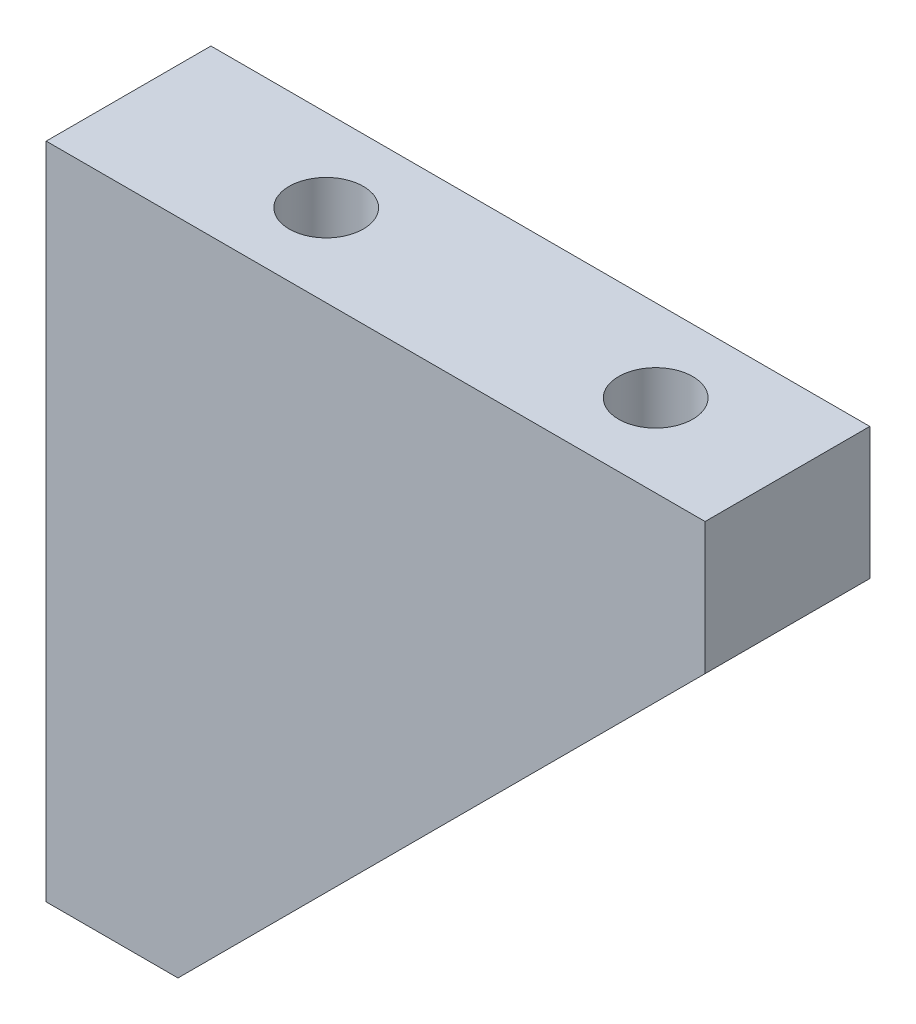
ISO-10303-21;
HEADER;
FILE_DESCRIPTION(('STEP AP214'),'2;1');
FILE_NAME('part.step','',(''),(''),'','','');
FILE_SCHEMA(('AUTOMOTIVE_DESIGN { 1 0 10303 214 1 1 1 1 }'));
ENDSEC;
DATA;
#1=APPLICATION_CONTEXT('core data for automotive mechanical design processes');
#2=APPLICATION_PROTOCOL_DEFINITION('international standard','automotive_design',2000,#1);
#3=PRODUCT_CONTEXT('',#1,'mechanical');
#4=PRODUCT('Part','Part','',(#3));
#5=PRODUCT_RELATED_PRODUCT_CATEGORY('part','',(#4));
#6=PRODUCT_DEFINITION_FORMATION('','',#4);
#7=PRODUCT_DEFINITION_CONTEXT('part definition',#1,'design');
#8=PRODUCT_DEFINITION('design','',#6,#7);
#9=PRODUCT_DEFINITION_SHAPE('','',#8);
#10=(LENGTH_UNIT() NAMED_UNIT(*) SI_UNIT(.MILLI.,.METRE.));
#11=(NAMED_UNIT(*) PLANE_ANGLE_UNIT() SI_UNIT($,.RADIAN.));
#12=(NAMED_UNIT(*) SI_UNIT($,.STERADIAN.) SOLID_ANGLE_UNIT());
#13=UNCERTAINTY_MEASURE_WITH_UNIT(LENGTH_MEASURE(1.E-05),#10,'distance_accuracy_value','');
#14=(GEOMETRIC_REPRESENTATION_CONTEXT(3) GLOBAL_UNCERTAINTY_ASSIGNED_CONTEXT((#13)) GLOBAL_UNIT_ASSIGNED_CONTEXT((#10,
#11,#12)) REPRESENTATION_CONTEXT('',''));
#15=CARTESIAN_POINT('',(0.,0.,0.));
#16=DIRECTION('',(0.,0.,1.));
#17=DIRECTION('',(1.,0.,0.));
#18=AXIS2_PLACEMENT_3D('',#15,#16,#17);
#19=CARTESIAN_POINT('',(0.,0.,10.));
#20=DIRECTION('',(1.,0.,0.));
#21=DIRECTION('',(0.,1.,0.));
#22=AXIS2_PLACEMENT_3D('',#19,#20,#21);
#23=PLANE('',#22);
#24=CARTESIAN_POINT('',(0.,-12.,5.));
#25=DIRECTION('',(-1.,0.,0.));
#26=DIRECTION('',(0.,0.,1.));
#27=AXIS2_PLACEMENT_3D('',#24,#25,#26);
#28=CIRCLE('',#27,2.24999999999999);
#29=CARTESIAN_POINT('',(0.,-12.,7.24999999999999));
#30=VERTEX_POINT('',#29);
#31=EDGE_CURVE('E207',#30,#30,#28,.T.);
#32=ORIENTED_EDGE('',*,*,#31,.F.);
#33=EDGE_LOOP('',(#32));
#34=FACE_BOUND('',#33,.T.);
#35=CARTESIAN_POINT('',(0.,-32.,5.));
#36=DIRECTION('',(-1.,0.,0.));
#37=DIRECTION('',(0.,0.,1.));
#38=AXIS2_PLACEMENT_3D('',#35,#36,#37);
#39=CIRCLE('',#38,2.24999999999999);
#40=CARTESIAN_POINT('',(0.,-32.,7.24999999999999));
#41=VERTEX_POINT('',#40);
#42=EDGE_CURVE('E159',#41,#41,#39,.T.);
#43=ORIENTED_EDGE('',*,*,#42,.F.);
#44=EDGE_LOOP('',(#43));
#45=FACE_BOUND('',#44,.T.);
#46=DIRECTION('',(0.,-1.,0.));
#47=VECTOR('',#46,1.);
#48=CARTESIAN_POINT('',(0.,0.,0.));
#49=LINE('',#48,#47);
#50=CARTESIAN_POINT('',(0.,0.,0.));
#51=VERTEX_POINT('',#50);
#52=CARTESIAN_POINT('',(0.,-40.,0.));
#53=VERTEX_POINT('',#52);
#54=EDGE_CURVE('E122',#51,#53,#49,.T.);
#55=ORIENTED_EDGE('',*,*,#54,.T.);
#56=DIRECTION('',(0.,0.,-1.));
#57=VECTOR('',#56,1.);
#58=CARTESIAN_POINT('',(0.,-40.,10.));
#59=LINE('',#58,#57);
#60=CARTESIAN_POINT('',(0.,-40.,10.));
#61=VERTEX_POINT('',#60);
#62=EDGE_CURVE('E43',#61,#53,#59,.T.);
#63=ORIENTED_EDGE('',*,*,#62,.F.);
#64=DIRECTION('',(0.,-1.,0.));
#65=VECTOR('',#64,1.);
#66=CARTESIAN_POINT('',(0.,0.,10.));
#67=LINE('',#66,#65);
#68=CARTESIAN_POINT('',(0.,0.,10.));
#69=VERTEX_POINT('',#68);
#70=EDGE_CURVE('E132',#69,#61,#67,.T.);
#71=ORIENTED_EDGE('',*,*,#70,.F.);
#72=DIRECTION('',(0.,0.,-1.));
#73=VECTOR('',#72,1.);
#74=CARTESIAN_POINT('',(0.,0.,10.));
#75=LINE('',#74,#73);
#76=EDGE_CURVE('E118',#69,#51,#75,.T.);
#77=ORIENTED_EDGE('',*,*,#76,.T.);
#78=EDGE_LOOP('',(#55,#63,#71,#77));
#79=FACE_BOUND('',#78,.T.);
#80=ADVANCED_FACE('F36',(#34,#45,#79),#23,.F.);
#81=CARTESIAN_POINT('',(0.,-40.,10.));
#82=DIRECTION('',(0.,1.,0.));
#83=DIRECTION('',(0.,0.,1.));
#84=AXIS2_PLACEMENT_3D('',#81,#82,#83);
#85=PLANE('',#84);
#86=DIRECTION('',(1.,0.,0.));
#87=VECTOR('',#86,1.);
#88=CARTESIAN_POINT('',(0.,-40.,0.));
#89=LINE('',#88,#87);
#90=CARTESIAN_POINT('',(8.00000000000001,-40.,0.));
#91=VERTEX_POINT('',#90);
#92=EDGE_CURVE('E125',#53,#91,#89,.T.);
#93=ORIENTED_EDGE('',*,*,#92,.T.);
#94=DIRECTION('',(0.,0.,-1.));
#95=VECTOR('',#94,1.);
#96=CARTESIAN_POINT('',(8.00000000000001,-40.,10.));
#97=LINE('',#96,#95);
#98=CARTESIAN_POINT('',(8.00000000000001,-40.,10.));
#99=VERTEX_POINT('',#98);
#100=EDGE_CURVE('E113',#99,#91,#97,.T.);
#101=ORIENTED_EDGE('',*,*,#100,.F.);
#102=DIRECTION('',(1.,0.,0.));
#103=VECTOR('',#102,1.);
#104=CARTESIAN_POINT('',(0.,-40.,10.));
#105=LINE('',#104,#103);
#106=EDGE_CURVE('E91',#61,#99,#105,.T.);
#107=ORIENTED_EDGE('',*,*,#106,.F.);
#108=ORIENTED_EDGE('',*,*,#62,.T.);
#109=EDGE_LOOP('',(#93,#101,#107,#108));
#110=FACE_BOUND('',#109,.T.);
#111=ADVANCED_FACE('F136',(#110),#85,.F.);
#112=CARTESIAN_POINT('',(40.,-8.,10.));
#113=DIRECTION('',(-0.707106781186548,0.707106781186548,0.));
#114=DIRECTION('',(-0.707106781186548,-0.707106781186548,0.));
#115=AXIS2_PLACEMENT_3D('',#112,#113,#114);
#116=PLANE('',#115);
#117=DIRECTION('',(0.707106781186548,0.707106781186548,0.));
#118=VECTOR('',#117,1.);
#119=CARTESIAN_POINT('',(40.,-8.,0.));
#120=LINE('',#119,#118);
#121=CARTESIAN_POINT('',(40.,-8.,0.));
#122=VERTEX_POINT('',#121);
#123=EDGE_CURVE('E110',#91,#122,#120,.T.);
#124=ORIENTED_EDGE('',*,*,#123,.T.);
#125=DIRECTION('',(0.,0.,-1.));
#126=VECTOR('',#125,1.);
#127=CARTESIAN_POINT('',(40.,-8.,10.));
#128=LINE('',#127,#126);
#129=CARTESIAN_POINT('',(40.,-8.,10.));
#130=VERTEX_POINT('',#129);
#131=EDGE_CURVE('E107',#130,#122,#128,.T.);
#132=ORIENTED_EDGE('',*,*,#131,.F.);
#133=DIRECTION('',(0.707106781186548,0.707106781186548,0.));
#134=VECTOR('',#133,1.);
#135=CARTESIAN_POINT('',(40.,-8.,10.));
#136=LINE('',#135,#134);
#137=EDGE_CURVE('E97',#99,#130,#136,.T.);
#138=ORIENTED_EDGE('',*,*,#137,.F.);
#139=ORIENTED_EDGE('',*,*,#100,.T.);
#140=EDGE_LOOP('',(#124,#132,#138,#139));
#141=FACE_BOUND('',#140,.T.);
#142=ADVANCED_FACE('F108',(#141),#116,.F.);
#143=CARTESIAN_POINT('',(40.,0.,10.));
#144=DIRECTION('',(-1.,0.,0.));
#145=DIRECTION('',(0.,0.,1.));
#146=AXIS2_PLACEMENT_3D('',#143,#144,#145);
#147=PLANE('',#146);
#148=DIRECTION('',(0.,1.,0.));
#149=VECTOR('',#148,1.);
#150=CARTESIAN_POINT('',(40.,0.,0.));
#151=LINE('',#150,#149);
#152=CARTESIAN_POINT('',(40.,0.,0.));
#153=VERTEX_POINT('',#152);
#154=EDGE_CURVE('E129',#122,#153,#151,.T.);
#155=ORIENTED_EDGE('',*,*,#154,.T.);
#156=DIRECTION('',(0.,0.,-1.));
#157=VECTOR('',#156,1.);
#158=CARTESIAN_POINT('',(40.,0.,10.));
#159=LINE('',#158,#157);
#160=CARTESIAN_POINT('',(40.,0.,10.));
#161=VERTEX_POINT('',#160);
#162=EDGE_CURVE('E114',#161,#153,#159,.T.);
#163=ORIENTED_EDGE('',*,*,#162,.F.);
#164=DIRECTION('',(0.,1.,0.));
#165=VECTOR('',#164,1.);
#166=CARTESIAN_POINT('',(40.,0.,10.));
#167=LINE('',#166,#165);
#168=EDGE_CURVE('E101',#130,#161,#167,.T.);
#169=ORIENTED_EDGE('',*,*,#168,.F.);
#170=ORIENTED_EDGE('',*,*,#131,.T.);
#171=EDGE_LOOP('',(#155,#163,#169,#170));
#172=FACE_BOUND('',#171,.T.);
#173=ADVANCED_FACE('F116',(#172),#147,.F.);
#174=CARTESIAN_POINT('',(0.,0.,10.));
#175=DIRECTION('',(0.,-1.,0.));
#176=DIRECTION('',(0.,0.,-1.));
#177=AXIS2_PLACEMENT_3D('',#174,#175,#176);
#178=PLANE('',#177);
#179=CARTESIAN_POINT('',(12.,0.,5.));
#180=DIRECTION('',(0.,1.,0.));
#181=DIRECTION('',(0.,0.,1.));
#182=AXIS2_PLACEMENT_3D('',#179,#180,#181);
#183=CIRCLE('',#182,2.24999999999999);
#184=CARTESIAN_POINT('',(12.,0.,7.24999999999999));
#185=VERTEX_POINT('',#184);
#186=EDGE_CURVE('E153',#185,#185,#183,.T.);
#187=ORIENTED_EDGE('',*,*,#186,.F.);
#188=EDGE_LOOP('',(#187));
#189=FACE_BOUND('',#188,.T.);
#190=CARTESIAN_POINT('',(32.,0.,5.));
#191=DIRECTION('',(0.,1.,0.));
#192=DIRECTION('',(0.,0.,1.));
#193=AXIS2_PLACEMENT_3D('',#190,#191,#192);
#194=CIRCLE('',#193,2.24999999999999);
#195=CARTESIAN_POINT('',(32.,0.,7.24999999999999));
#196=VERTEX_POINT('',#195);
#197=EDGE_CURVE('E147',#196,#196,#194,.T.);
#198=ORIENTED_EDGE('',*,*,#197,.F.);
#199=EDGE_LOOP('',(#198));
#200=FACE_BOUND('',#199,.T.);
#201=DIRECTION('',(-1.,0.,0.));
#202=VECTOR('',#201,1.);
#203=CARTESIAN_POINT('',(0.,0.,0.));
#204=LINE('',#203,#202);
#205=EDGE_CURVE('E82',#153,#51,#204,.T.);
#206=ORIENTED_EDGE('',*,*,#205,.T.);
#207=ORIENTED_EDGE('',*,*,#76,.F.);
#208=DIRECTION('',(-1.,0.,0.));
#209=VECTOR('',#208,1.);
#210=CARTESIAN_POINT('',(0.,0.,10.));
#211=LINE('',#210,#209);
#212=EDGE_CURVE('E58',#161,#69,#211,.T.);
#213=ORIENTED_EDGE('',*,*,#212,.F.);
#214=ORIENTED_EDGE('',*,*,#162,.T.);
#215=EDGE_LOOP('',(#206,#207,#213,#214));
#216=FACE_BOUND('',#215,.T.);
#217=ADVANCED_FACE('F142',(#189,#200,#216),#178,.F.);
#218=CARTESIAN_POINT('',(0.,0.,10.));
#219=DIRECTION('',(0.,0.,1.));
#220=DIRECTION('',(1.,0.,0.));
#221=AXIS2_PLACEMENT_3D('',#218,#219,#220);
#222=PLANE('',#221);
#223=ORIENTED_EDGE('',*,*,#70,.T.);
#224=ORIENTED_EDGE('',*,*,#106,.T.);
#225=ORIENTED_EDGE('',*,*,#137,.T.);
#226=ORIENTED_EDGE('',*,*,#168,.T.);
#227=ORIENTED_EDGE('',*,*,#212,.T.);
#228=EDGE_LOOP('',(#223,#224,#225,#226,#227));
#229=FACE_BOUND('',#228,.T.);
#230=ADVANCED_FACE('F99',(#229),#222,.T.);
#231=CARTESIAN_POINT('',(0.,0.,0.));
#232=DIRECTION('',(0.,0.,1.));
#233=DIRECTION('',(1.,0.,0.));
#234=AXIS2_PLACEMENT_3D('',#231,#232,#233);
#235=PLANE('',#234);
#236=ORIENTED_EDGE('',*,*,#54,.F.);
#237=ORIENTED_EDGE('',*,*,#205,.F.);
#238=ORIENTED_EDGE('',*,*,#154,.F.);
#239=ORIENTED_EDGE('',*,*,#123,.F.);
#240=ORIENTED_EDGE('',*,*,#92,.F.);
#241=EDGE_LOOP('',(#236,#237,#238,#239,#240));
#242=FACE_BOUND('',#241,.T.);
#243=ADVANCED_FACE('F141',(#242),#235,.F.);
#244=CARTESIAN_POINT('',(32.,-9.99999999999999,5.));
#245=DIRECTION('',(0.,1.,0.));
#246=DIRECTION('',(0.,0.,1.));
#247=AXIS2_PLACEMENT_3D('',#244,#245,#246);
#248=CONICAL_SURFACE('',#247,2.24999999999999,1.02974425867665);
#249=CARTESIAN_POINT('',(32.,-11.351936392812,5.));
#250=VERTEX_POINT('',#249);
#251=VERTEX_LOOP('',#250);
#252=FACE_BOUND('',#251,.T.);
#253=CARTESIAN_POINT('',(32.,-9.99999999999999,5.));
#254=DIRECTION('',(0.,1.,0.));
#255=DIRECTION('',(0.,0.,1.));
#256=AXIS2_PLACEMENT_3D('',#253,#254,#255);
#257=CIRCLE('',#256,2.24999999999999);
#258=CARTESIAN_POINT('',(32.,-9.99999999999999,7.24999999999999));
#259=VERTEX_POINT('',#258);
#260=EDGE_CURVE('E126',#259,#259,#257,.T.);
#261=ORIENTED_EDGE('',*,*,#260,.T.);
#262=EDGE_LOOP('',(#261));
#263=FACE_BOUND('',#262,.T.);
#264=ADVANCED_FACE('F256',(#252,#263),#248,.F.);
#265=CARTESIAN_POINT('',(32.,0.,5.));
#266=DIRECTION('',(0.,1.,0.));
#267=DIRECTION('',(0.,0.,1.));
#268=AXIS2_PLACEMENT_3D('',#265,#266,#267);
#269=CYLINDRICAL_SURFACE('',#268,2.24999999999999);
#270=ORIENTED_EDGE('',*,*,#260,.F.);
#271=EDGE_LOOP('',(#270));
#272=FACE_BOUND('',#271,.T.);
#273=ORIENTED_EDGE('',*,*,#197,.T.);
#274=EDGE_LOOP('',(#273));
#275=FACE_BOUND('',#274,.T.);
#276=ADVANCED_FACE('F195',(#272,#275),#269,.F.);
#277=CARTESIAN_POINT('',(12.,-9.99999999999999,5.));
#278=DIRECTION('',(0.,1.,0.));
#279=DIRECTION('',(0.,0.,1.));
#280=AXIS2_PLACEMENT_3D('',#277,#278,#279);
#281=CONICAL_SURFACE('',#280,2.24999999999999,1.02974425867665);
#282=CARTESIAN_POINT('',(12.,-11.351936392812,5.));
#283=VERTEX_POINT('',#282);
#284=VERTEX_LOOP('',#283);
#285=FACE_BOUND('',#284,.T.);
#286=CARTESIAN_POINT('',(12.,-9.99999999999999,5.));
#287=DIRECTION('',(0.,1.,0.));
#288=DIRECTION('',(0.,0.,1.));
#289=AXIS2_PLACEMENT_3D('',#286,#287,#288);
#290=CIRCLE('',#289,2.24999999999999);
#291=CARTESIAN_POINT('',(10.,-10.,6.03077640640438));
#292=VERTEX_POINT('',#291);
#293=CARTESIAN_POINT('',(9.99999999999999,-9.99999999999999,3.96922359359563));
#294=VERTEX_POINT('',#293);
#295=EDGE_CURVE('E150',#292,#294,#290,.T.);
#296=ORIENTED_EDGE('',*,*,#295,.T.);
#297=CARTESIAN_POINT('',(9.9998,-9.9998,3.96888510711605));
#298=CARTESIAN_POINT('',(10.0199713671876,-10.0199713671876,4.00304368759368));
#299=CARTESIAN_POINT('',(10.0399347553037,-10.0399347553037,4.03745606853985));
#300=CARTESIAN_POINT('',(10.0792951938878,-10.0792951938878,4.1069816294224));
#301=CARTESIAN_POINT('',(10.0986916153932,-10.0986916153932,4.14209551994402));
#302=CARTESIAN_POINT('',(10.1371913053952,-10.1371913053952,4.21401815912332));
#303=CARTESIAN_POINT('',(10.1562756455043,-10.1562756455043,4.25084735231351));
#304=CARTESIAN_POINT('',(10.1933375474993,-10.1933375474993,4.32558538433086));
#305=CARTESIAN_POINT('',(10.2113155369315,-10.2113155369315,4.36349379770676));
#306=CARTESIAN_POINT('',(10.2548468244322,-10.2548468244322,4.46102160591788));
#307=CARTESIAN_POINT('',(10.2794006667861,-10.279400666786,4.52155661280197));
#308=CARTESIAN_POINT('',(10.3222673136825,-10.3222673136825,4.64661637588643));
#309=CARTESIAN_POINT('',(10.3406278359546,-10.3406278359546,4.71110588075772));
#310=CARTESIAN_POINT('',(10.3626495285248,-10.3626495285248,4.82198736450129));
#311=CARTESIAN_POINT('',(10.3691755369963,-10.3691755369963,4.86719347725636));
#312=CARTESIAN_POINT('',(10.3764962122605,-10.3764962122605,4.95848403343301));
#313=CARTESIAN_POINT('',(10.3773033587189,-10.3773033587189,5.00456634417167));
#314=CARTESIAN_POINT('',(10.3730463791922,-10.3730463791922,5.09607528256868));
#315=CARTESIAN_POINT('',(10.3679916847553,-10.3679916847553,5.14150284477458));
#316=CARTESIAN_POINT('',(10.3529902905356,-10.3529902905356,5.23078541396133));
#317=CARTESIAN_POINT('',(10.3430270906471,-10.3430270906471,5.27463457787094));
#318=CARTESIAN_POINT('',(10.3167641344927,-10.3167641344927,5.37048493450964));
#319=CARTESIAN_POINT('',(10.2995219289716,-10.2995219289716,5.42195277638241));
#320=CARTESIAN_POINT('',(10.2615645792956,-10.2615645792956,5.52230485220766));
#321=CARTESIAN_POINT('',(10.2408417321592,-10.2408417321592,5.57118303225136));
#322=CARTESIAN_POINT('',(10.197087428829,-10.197087428829,5.66709211524245));
#323=CARTESIAN_POINT('',(10.1740464393342,-10.1740464393342,5.71411418237137));
#324=CARTESIAN_POINT('',(10.1264737425043,-10.1264737425043,5.80662660081224));
#325=CARTESIAN_POINT('',(10.1019416349786,-10.1019416349786,5.85211653578974));
#326=CARTESIAN_POINT('',(10.0642452575034,-10.0642452575034,5.91970958721427));
#327=CARTESIAN_POINT('',(10.0514640797278,-10.0514640797278,5.94224436124648));
#328=CARTESIAN_POINT('',(10.0257518187882,-10.0257518187882,5.98692642104506));
#329=CARTESIAN_POINT('',(10.0128220281552,-10.0128220281552,6.00907519324971));
#330=CARTESIAN_POINT('',(9.9998000000002,-9.9998000000002,6.03111489288418));
#331=B_SPLINE_CURVE_WITH_KNOTS('',3,(#297,#298,#299,#300,#301,#302,#303,#304,#305,#306,#307,
#308,#309,#310,#311,#312,#313,#314,#315,#316,#317,#318,#319,#320,#321,#322,#323,#324,#325,#326,
#327,#328,#329,#330),.UNSPECIFIED.,.F.,.F.,(4,2,2,2,2,2,2,2,2,2,2,2,2,2,2,2,4),(0.,
0.133518405319956,0.267179702806875,0.404126805218056,0.541020648049373,0.750041105535425,
0.95741223201884,1.09522162140978,1.23273019111671,1.37001781975045,1.50777012703197,
1.67819608099654,1.84900429668062,2.02054614166217,2.19213423059028,2.27879694684702,
2.36495902077232),.UNSPECIFIED.);
#332=EDGE_CURVE('E162',#294,#292,#331,.T.);
#333=ORIENTED_EDGE('',*,*,#332,.T.);
#334=EDGE_LOOP('',(#296,#333));
#335=FACE_BOUND('',#334,.T.);
#336=ADVANCED_FACE('F171',(#285,#335),#281,.F.);
#337=CARTESIAN_POINT('',(12.,0.,5.));
#338=DIRECTION('',(0.,1.,0.));
#339=DIRECTION('',(0.,0.,1.));
#340=AXIS2_PLACEMENT_3D('',#337,#338,#339);
#341=CYLINDRICAL_SURFACE('',#340,2.24999999999999);
#342=ORIENTED_EDGE('',*,*,#295,.F.);
#343=CARTESIAN_POINT('',(12.,-12.,5.));
#344=DIRECTION('',(0.707106781186547,0.707106781186547,0.));
#345=DIRECTION('',(-0.707106781186547,0.707106781186547,0.));
#346=AXIS2_PLACEMENT_3D('',#343,#344,#345);
#347=ELLIPSE('',#346,3.18198051533945,2.24999999999999);
#348=EDGE_CURVE('E11',#292,#294,#347,.F.);
#349=ORIENTED_EDGE('',*,*,#348,.T.);
#350=EDGE_LOOP('',(#342,#349));
#351=FACE_BOUND('',#350,.T.);
#352=ORIENTED_EDGE('',*,*,#186,.T.);
#353=EDGE_LOOP('',(#352));
#354=FACE_BOUND('',#353,.T.);
#355=ADVANCED_FACE('F188',(#351,#354),#341,.F.);
#356=CARTESIAN_POINT('',(10.,-32.,5.));
#357=DIRECTION('',(-1.,0.,0.));
#358=DIRECTION('',(0.,0.,1.));
#359=AXIS2_PLACEMENT_3D('',#356,#357,#358);
#360=CONICAL_SURFACE('',#359,2.24999999999999,1.02974425867665);
#361=CARTESIAN_POINT('',(11.351936392812,-32.,5.));
#362=VERTEX_POINT('',#361);
#363=VERTEX_LOOP('',#362);
#364=FACE_BOUND('',#363,.T.);
#365=CARTESIAN_POINT('',(10.,-32.,5.));
#366=DIRECTION('',(-1.,0.,0.));
#367=DIRECTION('',(0.,0.,1.));
#368=AXIS2_PLACEMENT_3D('',#365,#366,#367);
#369=CIRCLE('',#368,2.24999999999999);
#370=CARTESIAN_POINT('',(10.,-32.,7.24999999999999));
#371=VERTEX_POINT('',#370);
#372=EDGE_CURVE('E156',#371,#371,#369,.T.);
#373=ORIENTED_EDGE('',*,*,#372,.T.);
#374=EDGE_LOOP('',(#373));
#375=FACE_BOUND('',#374,.T.);
#376=ADVANCED_FACE('F185',(#364,#375),#360,.F.);
#377=CARTESIAN_POINT('',(0.,-32.,5.));
#378=DIRECTION('',(-1.,0.,0.));
#379=DIRECTION('',(0.,0.,1.));
#380=AXIS2_PLACEMENT_3D('',#377,#378,#379);
#381=CYLINDRICAL_SURFACE('',#380,2.24999999999999);
#382=ORIENTED_EDGE('',*,*,#372,.F.);
#383=EDGE_LOOP('',(#382));
#384=FACE_BOUND('',#383,.T.);
#385=ORIENTED_EDGE('',*,*,#42,.T.);
#386=EDGE_LOOP('',(#385));
#387=FACE_BOUND('',#386,.T.);
#388=ADVANCED_FACE('F181',(#384,#387),#381,.F.);
#389=CARTESIAN_POINT('',(10.,-12.,5.));
#390=DIRECTION('',(-1.,0.,0.));
#391=DIRECTION('',(0.,0.,1.));
#392=AXIS2_PLACEMENT_3D('',#389,#390,#391);
#393=CONICAL_SURFACE('',#392,2.24999999999999,1.02974425867665);
#394=CARTESIAN_POINT('',(11.351936392812,-12.,5.));
#395=VERTEX_POINT('',#394);
#396=VERTEX_LOOP('',#395);
#397=FACE_BOUND('',#396,.T.);
#398=CARTESIAN_POINT('',(10.,-12.,5.));
#399=DIRECTION('',(-1.,0.,0.));
#400=DIRECTION('',(0.,0.,1.));
#401=AXIS2_PLACEMENT_3D('',#398,#399,#400);
#402=CIRCLE('',#401,2.24999999999999);
#403=EDGE_CURVE('E49',#294,#292,#402,.T.);
#404=ORIENTED_EDGE('',*,*,#403,.T.);
#405=ORIENTED_EDGE('',*,*,#332,.F.);
#406=EDGE_LOOP('',(#404,#405));
#407=FACE_BOUND('',#406,.T.);
#408=ADVANCED_FACE('F175',(#397,#407),#393,.F.);
#409=CARTESIAN_POINT('',(0.,-12.,5.));
#410=DIRECTION('',(-1.,0.,0.));
#411=DIRECTION('',(0.,0.,1.));
#412=AXIS2_PLACEMENT_3D('',#409,#410,#411);
#413=CYLINDRICAL_SURFACE('',#412,2.24999999999999);
#414=ORIENTED_EDGE('',*,*,#31,.T.);
#415=EDGE_LOOP('',(#414));
#416=FACE_BOUND('',#415,.T.);
#417=ORIENTED_EDGE('',*,*,#403,.F.);
#418=ORIENTED_EDGE('',*,*,#348,.F.);
#419=EDGE_LOOP('',(#417,#418));
#420=FACE_BOUND('',#419,.T.);
#421=ADVANCED_FACE('F180',(#416,#420),#413,.F.);
#422=CLOSED_SHELL('',(#80,#111,#142,#173,#217,#230,#243,#264,#276,#336,#355,#376,#388,#408,#421));
#423=MANIFOLD_SOLID_BREP('B2',#422);
#424=ADVANCED_BREP_SHAPE_REPRESENTATION('',(#18,#423),#14);
#425=SHAPE_DEFINITION_REPRESENTATION(#9,#424);
ENDSEC;
END-ISO-10303-21;
